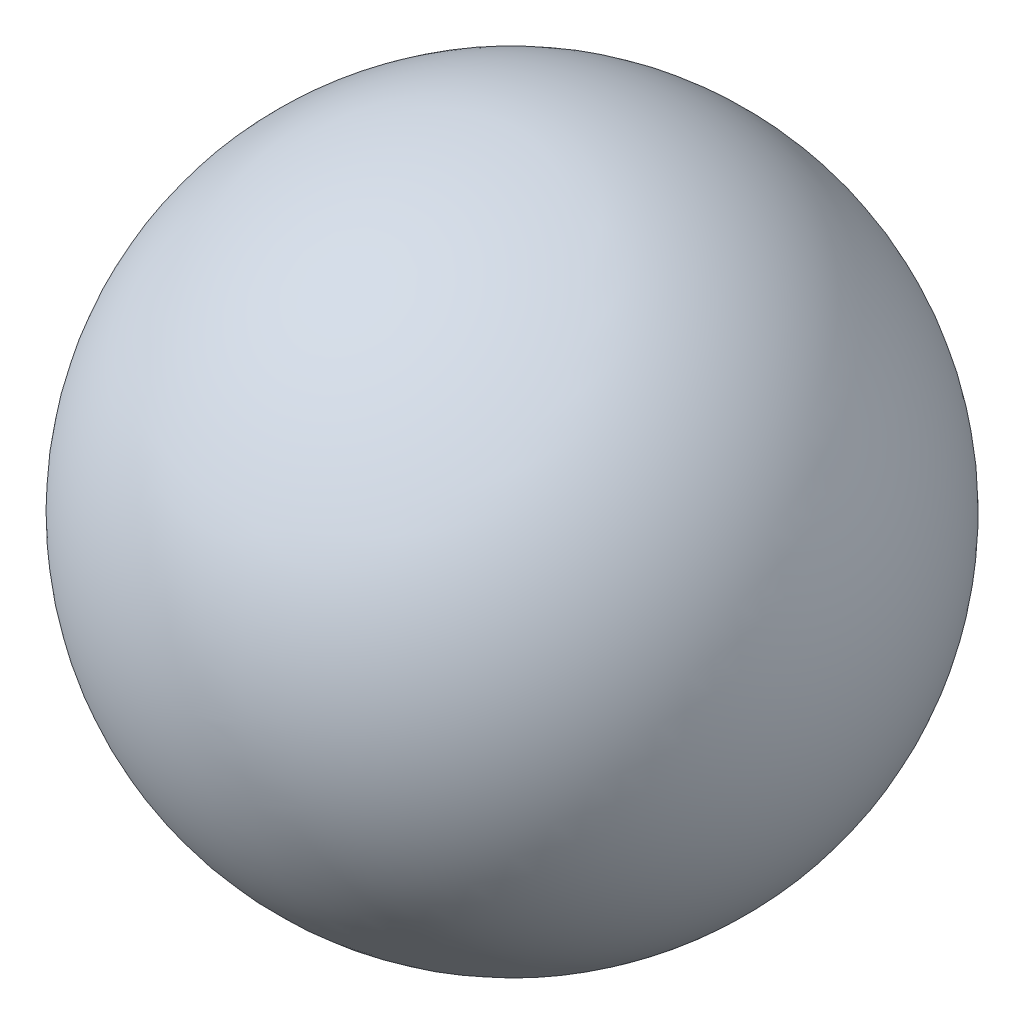
ISO-10303-21;
HEADER;
FILE_DESCRIPTION(('STEP AP214'),'2;1');
FILE_NAME('part.step','',(''),(''),'','','');
FILE_SCHEMA(('AUTOMOTIVE_DESIGN { 1 0 10303 214 1 1 1 1 }'));
ENDSEC;
DATA;
#1=APPLICATION_CONTEXT('core data for automotive mechanical design processes');
#2=APPLICATION_PROTOCOL_DEFINITION('international standard','automotive_design',2000,#1);
#3=PRODUCT_CONTEXT('',#1,'mechanical');
#4=PRODUCT('Part','Part','',(#3));
#5=PRODUCT_RELATED_PRODUCT_CATEGORY('part','',(#4));
#6=PRODUCT_DEFINITION_FORMATION('','',#4);
#7=PRODUCT_DEFINITION_CONTEXT('part definition',#1,'design');
#8=PRODUCT_DEFINITION('design','',#6,#7);
#9=PRODUCT_DEFINITION_SHAPE('','',#8);
#10=(LENGTH_UNIT() NAMED_UNIT(*) SI_UNIT(.MILLI.,.METRE.));
#11=(NAMED_UNIT(*) PLANE_ANGLE_UNIT() SI_UNIT($,.RADIAN.));
#12=(NAMED_UNIT(*) SI_UNIT($,.STERADIAN.) SOLID_ANGLE_UNIT());
#13=UNCERTAINTY_MEASURE_WITH_UNIT(LENGTH_MEASURE(1.E-05),#10,'distance_accuracy_value','');
#14=(GEOMETRIC_REPRESENTATION_CONTEXT(3) GLOBAL_UNCERTAINTY_ASSIGNED_CONTEXT((#13)) GLOBAL_UNIT_ASSIGNED_CONTEXT((#10,
#11,#12)) REPRESENTATION_CONTEXT('',''));
#15=CARTESIAN_POINT('',(0.,0.,0.));
#16=DIRECTION('',(0.,0.,1.));
#17=DIRECTION('',(1.,0.,0.));
#18=AXIS2_PLACEMENT_3D('',#15,#16,#17);
#19=CARTESIAN_POINT('',(67.76,65.1382943271418,23.7924014845213));
#20=DIRECTION('',(0.,0.939302704886864,0.343089534367082));
#21=DIRECTION('',(0.173648177666933,-0.337877233422051,0.925032586197921));
#22=AXIS2_PLACEMENT_3D('',#19,#20,#21);
#23=SPHERICAL_SURFACE('',#22,7.15);
#24=CARTESIAN_POINT('',(67.76,71.8543086670829,26.2454916552459));
#25=VERTEX_POINT('',#24);
#26=VERTEX_LOOP('',#25);
#27=FACE_BOUND('',#26,.T.);
#28=CARTESIAN_POINT('',(67.76,58.4222799872007,21.3393113137967));
#29=VERTEX_POINT('',#28);
#30=VERTEX_LOOP('',#29);
#31=FACE_BOUND('',#30,.T.);
#32=ADVANCED_FACE('F16',(#27,#31),#23,.T.);
#33=CLOSED_SHELL('',(#32));
#34=MANIFOLD_SOLID_BREP('B1',#33);
#35=ADVANCED_BREP_SHAPE_REPRESENTATION('',(#18,#34),#14);
#36=SHAPE_DEFINITION_REPRESENTATION(#9,#35);
ENDSEC;
END-ISO-10303-21;
